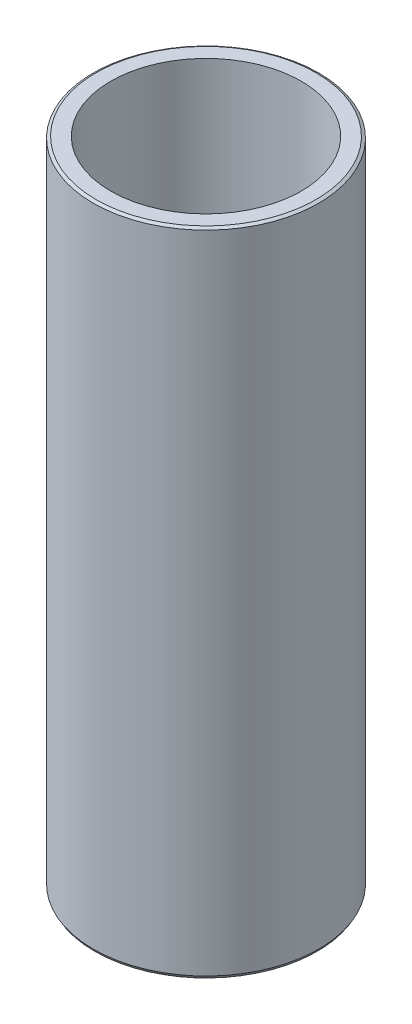
ISO-10303-21;
HEADER;
FILE_DESCRIPTION(('STEP AP214'),'2;1');
FILE_NAME('part.step','',(''),(''),'','','');
FILE_SCHEMA(('AUTOMOTIVE_DESIGN { 1 0 10303 214 1 1 1 1 }'));
ENDSEC;
DATA;
#1=APPLICATION_CONTEXT('core data for automotive mechanical design processes');
#2=APPLICATION_PROTOCOL_DEFINITION('international standard','automotive_design',2000,#1);
#3=PRODUCT_CONTEXT('',#1,'mechanical');
#4=PRODUCT('Part','Part','',(#3));
#5=PRODUCT_RELATED_PRODUCT_CATEGORY('part','',(#4));
#6=PRODUCT_DEFINITION_FORMATION('','',#4);
#7=PRODUCT_DEFINITION_CONTEXT('part definition',#1,'design');
#8=PRODUCT_DEFINITION('design','',#6,#7);
#9=PRODUCT_DEFINITION_SHAPE('','',#8);
#10=(LENGTH_UNIT() NAMED_UNIT(*) SI_UNIT(.MILLI.,.METRE.));
#11=(NAMED_UNIT(*) PLANE_ANGLE_UNIT() SI_UNIT($,.RADIAN.));
#12=(NAMED_UNIT(*) SI_UNIT($,.STERADIAN.) SOLID_ANGLE_UNIT());
#13=UNCERTAINTY_MEASURE_WITH_UNIT(LENGTH_MEASURE(1.E-05),#10,'distance_accuracy_value','');
#14=(GEOMETRIC_REPRESENTATION_CONTEXT(3) GLOBAL_UNCERTAINTY_ASSIGNED_CONTEXT((#13)) GLOBAL_UNIT_ASSIGNED_CONTEXT((#10,
#11,#12)) REPRESENTATION_CONTEXT('',''));
#15=CARTESIAN_POINT('',(0.,0.,0.));
#16=DIRECTION('',(0.,0.,1.));
#17=DIRECTION('',(1.,0.,0.));
#18=AXIS2_PLACEMENT_3D('',#15,#16,#17);
#19=CARTESIAN_POINT('',(0.,216.265143746076,0.));
#20=DIRECTION('',(0.,-1.,0.));
#21=DIRECTION('',(0.,0.,-1.));
#22=AXIS2_PLACEMENT_3D('',#19,#20,#21);
#23=CYLINDRICAL_SURFACE('',#22,37.5);
#24=CARTESIAN_POINT('',(0.,215.717458462048,0.));
#25=DIRECTION('',(0.,1.,0.));
#26=DIRECTION('',(0.,0.,1.));
#27=AXIS2_PLACEMENT_3D('',#24,#25,#26);
#28=CIRCLE('',#27,37.5);
#29=CARTESIAN_POINT('',(0.,215.717458462048,37.5));
#30=VERTEX_POINT('',#29);
#31=EDGE_CURVE('E50',#30,#30,#28,.F.);
#32=ORIENTED_EDGE('',*,*,#31,.T.);
#33=EDGE_LOOP('',(#32));
#34=FACE_BOUND('',#33,.T.);
#35=CARTESIAN_POINT('',(0.,0.94861873849314,0.));
#36=DIRECTION('',(0.,1.,0.));
#37=DIRECTION('',(0.,0.,1.));
#38=AXIS2_PLACEMENT_3D('',#35,#36,#37);
#39=CIRCLE('',#38,37.5);
#40=CARTESIAN_POINT('',(0.,0.94861873849314,37.5));
#41=VERTEX_POINT('',#40);
#42=EDGE_CURVE('E51',#41,#41,#39,.T.);
#43=ORIENTED_EDGE('',*,*,#42,.T.);
#44=EDGE_LOOP('',(#43));
#45=FACE_BOUND('',#44,.T.);
#46=ADVANCED_FACE('F39',(#34,#45),#23,.T.);
#47=CARTESIAN_POINT('',(0.,216.265143746076,0.));
#48=DIRECTION('',(0.,1.,0.));
#49=DIRECTION('',(0.,0.,1.));
#50=AXIS2_PLACEMENT_3D('',#47,#48,#49);
#51=PLANE('',#50);
#52=CARTESIAN_POINT('',(0.,216.265143746076,0.));
#53=DIRECTION('',(0.,1.,0.));
#54=DIRECTION('',(0.,0.,1.));
#55=AXIS2_PLACEMENT_3D('',#52,#53,#54);
#56=CIRCLE('',#55,36.5513812615069);
#57=CARTESIAN_POINT('',(0.,216.265143746076,36.5513812615069));
#58=VERTEX_POINT('',#57);
#59=EDGE_CURVE('E54',#58,#58,#56,.T.);
#60=ORIENTED_EDGE('',*,*,#59,.T.);
#61=EDGE_LOOP('',(#60));
#62=FACE_BOUND('',#61,.T.);
#63=CARTESIAN_POINT('',(0.,216.265143746076,0.));
#64=DIRECTION('',(0.,1.,0.));
#65=DIRECTION('',(0.,0.,1.));
#66=AXIS2_PLACEMENT_3D('',#63,#64,#65);
#67=CIRCLE('',#66,31.6721351151343);
#68=CARTESIAN_POINT('',(0.,216.265143746076,31.6721351151343));
#69=VERTEX_POINT('',#68);
#70=EDGE_CURVE('E58',#69,#69,#67,.T.);
#71=ORIENTED_EDGE('',*,*,#70,.F.);
#72=EDGE_LOOP('',(#71));
#73=FACE_BOUND('',#72,.T.);
#74=ADVANCED_FACE('F69',(#62,#73),#51,.T.);
#75=CARTESIAN_POINT('',(0.,0.,0.));
#76=DIRECTION('',(0.,1.,0.));
#77=DIRECTION('',(0.,0.,1.));
#78=AXIS2_PLACEMENT_3D('',#75,#76,#77);
#79=PLANE('',#78);
#80=CARTESIAN_POINT('',(0.,0.,0.));
#81=DIRECTION('',(0.,1.,0.));
#82=DIRECTION('',(0.,0.,1.));
#83=AXIS2_PLACEMENT_3D('',#80,#81,#82);
#84=CIRCLE('',#83,36.9523147159727);
#85=CARTESIAN_POINT('',(0.,0.,36.9523147159727));
#86=VERTEX_POINT('',#85);
#87=EDGE_CURVE('E10',#86,#86,#84,.F.);
#88=ORIENTED_EDGE('',*,*,#87,.T.);
#89=EDGE_LOOP('',(#88));
#90=FACE_BOUND('',#89,.T.);
#91=CARTESIAN_POINT('',(0.,0.,0.));
#92=DIRECTION('',(0.,1.,0.));
#93=DIRECTION('',(0.,0.,1.));
#94=AXIS2_PLACEMENT_3D('',#91,#92,#93);
#95=CIRCLE('',#94,31.6721351151343);
#96=CARTESIAN_POINT('',(0.,0.,31.6721351151343));
#97=VERTEX_POINT('',#96);
#98=EDGE_CURVE('E63',#97,#97,#95,.T.);
#99=ORIENTED_EDGE('',*,*,#98,.T.);
#100=EDGE_LOOP('',(#99));
#101=FACE_BOUND('',#100,.T.);
#102=ADVANCED_FACE('F75',(#90,#101),#79,.F.);
#103=CARTESIAN_POINT('',(0.,216.265143746076,0.));
#104=DIRECTION('',(0.,-1.,0.));
#105=DIRECTION('',(0.,0.,-1.));
#106=AXIS2_PLACEMENT_3D('',#103,#104,#105);
#107=CYLINDRICAL_SURFACE('',#106,31.6721351151343);
#108=ORIENTED_EDGE('',*,*,#70,.T.);
#109=EDGE_LOOP('',(#108));
#110=FACE_BOUND('',#109,.T.);
#111=ORIENTED_EDGE('',*,*,#98,.F.);
#112=EDGE_LOOP('',(#111));
#113=FACE_BOUND('',#112,.T.);
#114=ADVANCED_FACE('F70',(#110,#113),#107,.F.);
#115=CARTESIAN_POINT('',(0.,216.265143746076,0.));
#116=DIRECTION('',(0.,-1.,0.));
#117=DIRECTION('',(0.,0.,-1.));
#118=AXIS2_PLACEMENT_3D('',#115,#116,#117);
#119=CONICAL_SURFACE('',#118,36.5513812615069,1.04719755119659);
#120=ORIENTED_EDGE('',*,*,#31,.F.);
#121=EDGE_LOOP('',(#120));
#122=FACE_BOUND('',#121,.T.);
#123=ORIENTED_EDGE('',*,*,#59,.F.);
#124=EDGE_LOOP('',(#123));
#125=FACE_BOUND('',#124,.T.);
#126=ADVANCED_FACE('F81',(#122,#125),#119,.T.);
#127=CARTESIAN_POINT('',(0.,0.94861873849314,0.));
#128=DIRECTION('',(0.,1.,0.));
#129=DIRECTION('',(0.,0.,1.));
#130=AXIS2_PLACEMENT_3D('',#127,#128,#129);
#131=CONICAL_SURFACE('',#130,37.5,0.523598775598297);
#132=ORIENTED_EDGE('',*,*,#87,.F.);
#133=EDGE_LOOP('',(#132));
#134=FACE_BOUND('',#133,.T.);
#135=ORIENTED_EDGE('',*,*,#42,.F.);
#136=EDGE_LOOP('',(#135));
#137=FACE_BOUND('',#136,.T.);
#138=ADVANCED_FACE('F45',(#134,#137),#131,.T.);
#139=CLOSED_SHELL('',(#46,#74,#102,#114,#126,#138));
#140=MANIFOLD_SOLID_BREP('B2',#139);
#141=ADVANCED_BREP_SHAPE_REPRESENTATION('',(#18,#140),#14);
#142=SHAPE_DEFINITION_REPRESENTATION(#9,#141);
ENDSEC;
END-ISO-10303-21;
